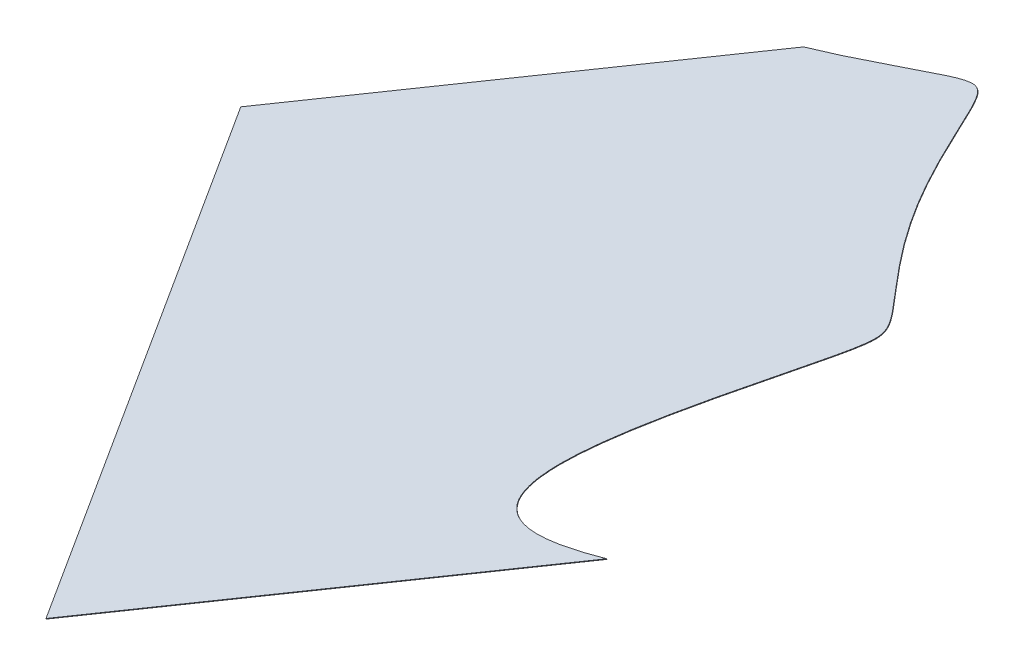
ISO-10303-21;
HEADER;
FILE_DESCRIPTION(('STEP AP214'),'2;1');
FILE_NAME('part.step','',(''),(''),'','','');
FILE_SCHEMA(('AUTOMOTIVE_DESIGN { 1 0 10303 214 1 1 1 1 }'));
ENDSEC;
DATA;
#1=APPLICATION_CONTEXT('core data for automotive mechanical design processes');
#2=APPLICATION_PROTOCOL_DEFINITION('international standard','automotive_design',2000,#1);
#3=PRODUCT_CONTEXT('',#1,'mechanical');
#4=PRODUCT('Part','Part','',(#3));
#5=PRODUCT_RELATED_PRODUCT_CATEGORY('part','',(#4));
#6=PRODUCT_DEFINITION_FORMATION('','',#4);
#7=PRODUCT_DEFINITION_CONTEXT('part definition',#1,'design');
#8=PRODUCT_DEFINITION('design','',#6,#7);
#9=PRODUCT_DEFINITION_SHAPE('','',#8);
#10=(LENGTH_UNIT() NAMED_UNIT(*) SI_UNIT(.MILLI.,.METRE.));
#11=(NAMED_UNIT(*) PLANE_ANGLE_UNIT() SI_UNIT($,.RADIAN.));
#12=(NAMED_UNIT(*) SI_UNIT($,.STERADIAN.) SOLID_ANGLE_UNIT());
#13=UNCERTAINTY_MEASURE_WITH_UNIT(LENGTH_MEASURE(1.E-05),#10,'distance_accuracy_value','');
#14=(GEOMETRIC_REPRESENTATION_CONTEXT(3) GLOBAL_UNCERTAINTY_ASSIGNED_CONTEXT((#13)) GLOBAL_UNIT_ASSIGNED_CONTEXT((#10,
#11,#12)) REPRESENTATION_CONTEXT('',''));
#15=CARTESIAN_POINT('',(0.,0.,0.));
#16=DIRECTION('',(0.,0.,1.));
#17=DIRECTION('',(1.,0.,0.));
#18=AXIS2_PLACEMENT_3D('',#15,#16,#17);
#19=CARTESIAN_POINT('',(1953.44669589325,548.982220738593,241.87330581842));
#20=DIRECTION('',(-0.466019808001318,0.225398203679601,-0.855582367939186));
#21=DIRECTION('',(-0.87818083768511,0.,0.478328774299309));
#22=AXIS2_PLACEMENT_3D('',#19,#20,#21);
#23=PLANE('',#22);
#24=DIRECTION('',(0.856999370345969,0.355384204241095,-0.373167719132479));
#25=VECTOR('',#24,1.);
#26=CARTESIAN_POINT('',(1953.46869080579,548.891507028651,241.837427598694));
#27=LINE('',#26,#25);
#28=CARTESIAN_POINT('',(1953.46869080579,548.891507028651,241.837427598694));
#29=VERTEX_POINT('',#28);
#30=CARTESIAN_POINT('',(2015.71277907775,574.703154673519,214.734158618986));
#31=VERTEX_POINT('',#30);
#32=EDGE_CURVE('E106',#29,#31,#27,.T.);
#33=ORIENTED_EDGE('',*,*,#32,.F.);
#34=DIRECTION('',(0.219949125429105,-0.907137099425403,-0.358782197257666));
#35=VECTOR('',#34,1.);
#36=CARTESIAN_POINT('',(1953.44669589325,548.982220738593,241.87330581842));
#37=LINE('',#36,#35);
#38=CARTESIAN_POINT('',(1953.44669589325,548.982220738593,241.87330581842));
#39=VERTEX_POINT('',#38);
#40=EDGE_CURVE('E13',#39,#29,#37,.T.);
#41=ORIENTED_EDGE('',*,*,#40,.F.);
#42=DIRECTION('',(0.856999370345969,0.355384204241095,-0.373167719132479));
#43=VECTOR('',#42,1.);
#44=CARTESIAN_POINT('',(1953.44669589325,548.982220738593,241.87330581842));
#45=LINE('',#44,#43);
#46=CARTESIAN_POINT('',(2015.69078416521,574.793868383461,214.770036838712));
#47=VERTEX_POINT('',#46);
#48=EDGE_CURVE('E88',#39,#47,#45,.T.);
#49=ORIENTED_EDGE('',*,*,#48,.T.);
#50=DIRECTION('',(0.219949125429105,-0.907137099425403,-0.358782197257666));
#51=VECTOR('',#50,1.);
#52=CARTESIAN_POINT('',(2015.69078416521,574.793868383461,214.770036838712));
#53=LINE('',#52,#51);
#54=EDGE_CURVE('E56',#47,#31,#53,.T.);
#55=ORIENTED_EDGE('',*,*,#54,.T.);
#56=EDGE_LOOP('',(#33,#41,#49,#55));
#57=FACE_BOUND('',#56,.T.);
#58=ADVANCED_FACE('F40',(#57),#23,.T.);
#59=CARTESIAN_POINT('',(1953.44669589325,548.982220738593,241.87330581842));
#60=DIRECTION('',(0.856999370345968,0.355384204241096,-0.373167719132481));
#61=DIRECTION('',(-0.399229280804334,0.,-0.916851122783003));
#62=AXIS2_PLACEMENT_3D('',#59,#60,#61);
#63=PLANE('',#62);
#64=DIRECTION('',(0.46601980800132,-0.225398203679599,0.855582367939185));
#65=VECTOR('',#64,1.);
#66=CARTESIAN_POINT('',(1953.46869080579,548.891507028651,241.837427598694));
#67=LINE('',#66,#65);
#68=CARTESIAN_POINT('',(1990.46222722638,530.998970029593,309.755179045613));
#69=VERTEX_POINT('',#68);
#70=EDGE_CURVE('E94',#29,#69,#67,.T.);
#71=ORIENTED_EDGE('',*,*,#70,.T.);
#72=DIRECTION('',(0.219949125429105,-0.907137099425403,-0.358782197257666));
#73=VECTOR('',#72,1.);
#74=CARTESIAN_POINT('',(1990.44023231384,531.089683739536,309.791057265338));
#75=LINE('',#74,#73);
#76=CARTESIAN_POINT('',(1990.44023231384,531.089683739536,309.791057265338));
#77=VERTEX_POINT('',#76);
#78=EDGE_CURVE('E48',#77,#69,#75,.T.);
#79=ORIENTED_EDGE('',*,*,#78,.F.);
#80=DIRECTION('',(0.46601980800132,-0.225398203679599,0.855582367939185));
#81=VECTOR('',#80,1.);
#82=CARTESIAN_POINT('',(1953.44669589325,548.982220738593,241.87330581842));
#83=LINE('',#82,#81);
#84=EDGE_CURVE('E82',#39,#77,#83,.T.);
#85=ORIENTED_EDGE('',*,*,#84,.F.);
#86=ORIENTED_EDGE('',*,*,#40,.T.);
#87=EDGE_LOOP('',(#71,#79,#85,#86));
#88=FACE_BOUND('',#87,.T.);
#89=ADVANCED_FACE('F92',(#88),#63,.F.);
#90=CARTESIAN_POINT('',(1990.44023231384,531.089683739536,309.791057265338));
#91=DIRECTION('',(-0.466019808001315,0.225398203679601,-0.855582367939187));
#92=DIRECTION('',(-0.878180837685111,0.,0.478328774299307));
#93=AXIS2_PLACEMENT_3D('',#90,#91,#92);
#94=PLANE('',#93);
#95=DIRECTION('',(0.85699937034597,0.355384204241095,-0.373167719132477));
#96=VECTOR('',#95,1.);
#97=CARTESIAN_POINT('',(1990.46222722638,530.998970029593,309.755179045613));
#98=LINE('',#97,#96);
#99=CARTESIAN_POINT('',(2052.48597259183,556.719244925307,282.747855130387));
#100=VERTEX_POINT('',#99);
#101=EDGE_CURVE('E127',#69,#100,#98,.T.);
#102=ORIENTED_EDGE('',*,*,#101,.T.);
#103=DIRECTION('',(0.219949125429105,-0.907137099425403,-0.358782197257666));
#104=VECTOR('',#103,1.);
#105=CARTESIAN_POINT('',(2052.46397767929,556.80995863525,282.783733350113));
#106=LINE('',#105,#104);
#107=CARTESIAN_POINT('',(2052.46397767929,556.80995863525,282.783733350113));
#108=VERTEX_POINT('',#107);
#109=EDGE_CURVE('E70',#108,#100,#106,.T.);
#110=ORIENTED_EDGE('',*,*,#109,.F.);
#111=DIRECTION('',(0.85699937034597,0.355384204241095,-0.373167719132477));
#112=VECTOR('',#111,1.);
#113=CARTESIAN_POINT('',(1990.44023231384,531.089683739536,309.791057265338));
#114=LINE('',#113,#112);
#115=EDGE_CURVE('E87',#77,#108,#114,.T.);
#116=ORIENTED_EDGE('',*,*,#115,.F.);
#117=ORIENTED_EDGE('',*,*,#78,.T.);
#118=EDGE_LOOP('',(#102,#110,#116,#117));
#119=FACE_BOUND('',#118,.T.);
#120=ADVANCED_FACE('F97',(#119),#94,.F.);
#121=CARTESIAN_POINT('',(2015.69078416521,574.793868383461,214.770036838712));
#122=CARTESIAN_POINT('',(2017.5561158413,575.274671333858,214.69791474563));
#123=CARTESIAN_POINT('',(2019.69416695316,575.847452367663,214.560426169518));
#124=CARTESIAN_POINT('',(2021.53957381669,576.341834398673,214.441756245956));
#125=CARTESIAN_POINT('',(2023.68105462988,576.929727516319,214.26816116235));
#126=CARTESIAN_POINT('',(2025.44031449815,577.412690876223,214.125550095261));
#127=CARTESIAN_POINT('',(2027.66178334766,578.031113715501,213.923800480655));
#128=CARTESIAN_POINT('',(2028.49943246852,578.26430237703,213.847726766027));
#129=CARTESIAN_POINT('',(2029.65090272471,578.585836107122,213.740669337398));
#130=CARTESIAN_POINT('',(2030.6447480039,578.863355025246,213.648267020037));
#131=CARTESIAN_POINT('',(2031.63930905602,579.141170934682,213.555552596318));
#132=CARTESIAN_POINT('',(2034.1738062729,579.849145219185,213.319283089905));
#133=CARTESIAN_POINT('',(2035.62079046512,580.244895824693,213.205740252216));
#134=CARTESIAN_POINT('',(2036.77674600766,580.561050008246,213.115034028022));
#135=CARTESIAN_POINT('',(2037.61862253253,580.782529105123,213.071158104742));
#136=CARTESIAN_POINT('',(2038.16734145831,580.926884920416,213.042560621881));
#137=CARTESIAN_POINT('',(2038.62197747392,581.0414935971,213.031498232093));
#138=CARTESIAN_POINT('',(2039.18132027129,581.182497687446,213.017888073994));
#139=CARTESIAN_POINT('',(2039.6290223054,581.286195165266,213.030162489065));
#140=CARTESIAN_POINT('',(2040.20343116855,581.419240686185,213.045910759721));
#141=CARTESIAN_POINT('',(2040.91145787125,581.552440341015,213.143182881302));
#142=CARTESIAN_POINT('',(2041.4095308962,581.625679217081,213.263347775125));
#143=CARTESIAN_POINT('',(2041.88265685357,581.663801098748,213.45700807352));
#144=CARTESIAN_POINT('',(2042.30324627741,581.653936005708,213.739790409436));
#145=CARTESIAN_POINT('',(2042.65579184973,581.595262289171,214.104265559923));
#146=CARTESIAN_POINT('',(2042.94362761912,581.499665028317,214.522427466547));
#147=CARTESIAN_POINT('',(2043.27569538638,581.335300474822,215.141575241982));
#148=CARTESIAN_POINT('',(2043.48514383052,581.17535543995,215.67437781294));
#149=CARTESIAN_POINT('',(2043.64213097823,581.055472406598,216.073727429733));
#150=CARTESIAN_POINT('',(2043.81952455994,580.889328939337,216.602550954379));
#151=CARTESIAN_POINT('',(2043.95419847826,580.763195899328,217.00402396979));
#152=CARTESIAN_POINT('',(2044.11977225121,580.592322372914,217.537560815086));
#153=CARTESIAN_POINT('',(2044.23663092699,580.471723236542,217.91412050877));
#154=CARTESIAN_POINT('',(2044.40706489422,580.28899669804,218.480605762814));
#155=CARTESIAN_POINT('',(2044.54898414278,580.136841505867,218.952314324686));
#156=CARTESIAN_POINT('',(2044.82270480859,579.841420463608,219.867053157739));
#157=CARTESIAN_POINT('',(2045.2899626811,579.350315644315,221.395201337575));
#158=CARTESIAN_POINT('',(2045.56789647397,579.082843585181,222.241857400474));
#159=CARTESIAN_POINT('',(2045.88753759904,578.77523410372,223.215564461048));
#160=CARTESIAN_POINT('',(2046.55160176237,578.210197181406,225.051291795804));
#161=CARTESIAN_POINT('',(2047.67057423651,577.385076245862,227.823488512399));
#162=CARTESIAN_POINT('',(2049.44760771019,576.426926937041,231.335451349033));
#163=CARTESIAN_POINT('',(2051.04144092468,575.800389679922,233.896663746794));
#164=CARTESIAN_POINT('',(2052.17203740678,575.417552928686,235.55772478069));
#165=CARTESIAN_POINT('',(2053.36153125628,575.066153962238,237.175405857126));
#166=CARTESIAN_POINT('',(2054.01255789175,574.895175842118,238.006810919402));
#167=CARTESIAN_POINT('',(2054.5863817734,574.744473362037,238.739622841465));
#168=CARTESIAN_POINT('',(2055.28027398594,574.577325297076,239.58762254279));
#169=CARTESIAN_POINT('',(2055.56957911362,574.507636098379,239.941179849568));
#170=CARTESIAN_POINT('',(2055.92975386732,574.423035897713,240.375883979018));
#171=CARTESIAN_POINT('',(2056.05970574154,574.392511951983,240.532726222317));
#172=CARTESIAN_POINT('',(2056.57769690728,574.271601876211,241.155983789225));
#173=CARTESIAN_POINT('',(2056.98713624293,574.176030089719,241.648629573572));
#174=CARTESIAN_POINT('',(2057.22254394287,574.119867204669,241.934945770822));
#175=CARTESIAN_POINT('',(2057.59318038967,574.03144183811,242.385734840345));
#176=CARTESIAN_POINT('',(2057.86089944492,573.963066940038,242.722735894737));
#177=CARTESIAN_POINT('',(2058.22151523933,573.870966405157,243.176674083165));
#178=CARTESIAN_POINT('',(2058.48178916132,573.793377019387,243.532408656518));
#179=CARTESIAN_POINT('',(2058.82596056558,573.690777236624,244.002811786862));
#180=CARTESIAN_POINT('',(2059.18848222762,573.538885479797,244.609093179564));
#181=CARTESIAN_POINT('',(2059.40584275279,573.413261919271,245.059968532259));
#182=CARTESIAN_POINT('',(2059.55377352892,573.264429862375,245.526960279639));
#183=CARTESIAN_POINT('',(2059.59991396928,573.088342441066,246.000461984614));
#184=CARTESIAN_POINT('',(2059.53119360486,572.888944174193,246.462487644343));
#185=CARTESIAN_POINT('',(2059.3681549014,572.67633742918,246.900088079796));
#186=CARTESIAN_POINT('',(2059.05459237652,572.374148149904,247.471909381786));
#187=CARTESIAN_POINT('',(2058.73149546915,572.129746477429,247.891776764307));
#188=CARTESIAN_POINT('',(2058.48055359521,571.939925367154,248.217878021762));
#189=CARTESIAN_POINT('',(2058.13401286032,571.701653111335,248.607875832474));
#190=CARTESIAN_POINT('',(2057.85475001427,571.509639354814,248.92215893863));
#191=CARTESIAN_POINT('',(2057.50030442041,571.277101559491,249.292811841111));
#192=CARTESIAN_POINT('',(2056.95984005909,570.922524176658,249.85798936814));
#193=CARTESIAN_POINT('',(2056.18445443078,570.43476374814,250.61588703308));
#194=CARTESIAN_POINT('',(2055.6147954892,570.076416779471,251.17269794867));
#195=CARTESIAN_POINT('',(2054.83925761282,569.596454054353,251.91078673533));
#196=CARTESIAN_POINT('',(2054.28437894762,569.253052288469,252.43887147911));
#197=CARTESIAN_POINT('',(2053.48203520935,568.759588047022,253.194664044075));
#198=CARTESIAN_POINT('',(2053.22604554515,568.602147115617,253.43580144651));
#199=CARTESIAN_POINT('',(2052.12043773109,567.922884718318,254.475447928184));
#200=CARTESIAN_POINT('',(2051.29858914855,567.417958078598,255.248264451776));
#201=CARTESIAN_POINT('',(2050.75974804653,567.086156465996,255.756851345722));
#202=CARTESIAN_POINT('',(2050.02552326167,566.634043650707,256.449851752311));
#203=CARTESIAN_POINT('',(2049.40402735175,566.249500407372,257.04111843761));
#204=CARTESIAN_POINT('',(2047.93558836198,565.340921150861,258.43813334982));
#205=CARTESIAN_POINT('',(2046.72944941325,564.582294597931,259.616812467921));
#206=CARTESIAN_POINT('',(2045.30791979076,563.688193533924,261.005978520103));
#207=CARTESIAN_POINT('',(2044.10075437581,562.908399005481,262.237549018274));
#208=CARTESIAN_POINT('',(2042.69534070306,562.00054174033,263.671375729708));
#209=CARTESIAN_POINT('',(2041.51927358197,561.208206444526,264.953718640794));
#210=CARTESIAN_POINT('',(2040.15959687961,560.29217042682,266.436263088613));
#211=CARTESIAN_POINT('',(2039.06905588237,559.50543657709,267.75687466717));
#212=CARTESIAN_POINT('',(2037.7757378265,558.572416089454,269.32304302185));
#213=CARTESIAN_POINT('',(2036.83410140014,557.801916807903,270.693892463888));
#214=CARTESIAN_POINT('',(2035.62504843415,556.812602444556,272.454051201825));
#215=CARTESIAN_POINT('',(2034.97148209541,556.071190788949,273.927955643502));
#216=CARTESIAN_POINT('',(2034.55112313923,555.59433172939,274.875937349242));
#217=CARTESIAN_POINT('',(2034.35623782451,555.21559856133,275.71404485652));
#218=CARTESIAN_POINT('',(2034.11359089145,554.744047168086,276.757551990497));
#219=CARTESIAN_POINT('',(2034.21881543302,554.42109409864,277.638606733391));
#220=CARTESIAN_POINT('',(2034.34245629744,554.041618017514,278.673863037548));
#221=CARTESIAN_POINT('',(2035.5156135139,553.696971431771,280.264456473425));
#222=CARTESIAN_POINT('',(2036.51217964776,553.70591957432,280.85277066268));
#223=CARTESIAN_POINT('',(2037.31956601144,553.713169076414,281.329404212447));
#224=CARTESIAN_POINT('',(2038.41389122379,553.83574657784,281.690350979827));
#225=CARTESIAN_POINT('',(2039.31339193385,553.936501406775,281.987037805544));
#226=CARTESIAN_POINT('',(2040.41154329238,554.115689577615,282.207196982764));
#227=CARTESIAN_POINT('',(2042.15599619246,554.400336426936,282.556927748199));
#228=CARTESIAN_POINT('',(2044.42528093741,554.887088551623,282.717404730933));
#229=CARTESIAN_POINT('',(2046.25198766614,555.278909535466,282.846583929276));
#230=CARTESIAN_POINT('',(2048.44812866024,555.807968267909,282.855253498224));
#231=CARTESIAN_POINT('',(2050.30638720704,556.255629831517,282.86258922969));
#232=CARTESIAN_POINT('',(2052.46397767929,556.809958635251,282.783733350113));
#233=B_SPLINE_CURVE_WITH_KNOTS('',2,(#121,#122,#123,#124,#125,#126,#127,#128,#129,#130,#131,
#132,#133,#134,#135,#136,#137,#138,#139,#140,#141,#142,#143,#144,#145,#146,#147,#148,#149,#150,
#151,#152,#153,#154,#155,#156,#157,#158,#159,#160,#161,#162,#163,#164,#165,#166,#167,#168,#169,
#170,#171,#172,#173,#174,#175,#176,#177,#178,#179,#180,#181,#182,#183,#184,#185,#186,#187,#188,
#189,#190,#191,#192,#193,#194,#195,#196,#197,#198,#199,#200,#201,#202,#203,#204,#205,#206,#207,
#208,#209,#210,#211,#212,#213,#214,#215,#216,#217,#218,#219,#220,#221,#222,#223,#224,#225,#226,
#227,#228,#229,#230,#231,#232),.UNSPECIFIED.,.F.,.F.,(3,2,2,2,2,2,2,2,2,2,1,1,1,1,1,1,1,2,2,2,2,
1,1,2,1,1,1,1,1,1,2,2,2,2,2,2,2,1,1,1,1,1,1,1,2,2,2,2,2,2,2,2,2,2,2,2,2,2,2,2,2,1,2,2,2,2,2,3),
(0.,0.03125,0.0625,0.09375,0.109375,0.125,0.15625,0.171875,0.1796875,0.1875,0.1953125,
0.19921875,0.203125,0.20703125,0.2109375,0.21484375,0.21875,0.2265625,0.234375,0.2421875,0.25,
0.2578125,0.265625,0.28125,0.296875,0.3125,0.34375,0.375,0.390625,0.40625,0.421875,0.4375,
0.4453125,0.453125,0.4609375,0.46875,0.4765625,0.484375,0.48828125,0.4921875,0.49609375,0.5,
0.50390625,0.5078125,0.515625,0.5234375,0.53125,0.546875,0.5625,0.578125,0.59375,0.609375,0.625,
0.656097650527954,0.687195301055908,0.718597650527954,0.75,0.78125,0.8125,0.828125,0.84375,
0.859375,0.875,0.890625,0.90625,0.9375,0.96875,1.),.UNSPECIFIED.);
#234=DIRECTION('',(0.219949125429105,-0.907137099425403,-0.358782197257666));
#235=VECTOR('',#234,1.);
#236=SURFACE_OF_LINEAR_EXTRUSION('',#233,#235);
#237=CARTESIAN_POINT('',(2015.71277907775,574.703154673519,214.734158618986));
#238=CARTESIAN_POINT('',(2017.57811075384,575.183957623915,214.662036525904));
#239=CARTESIAN_POINT('',(2019.7161618657,575.75673865772,214.524547949792));
#240=CARTESIAN_POINT('',(2021.56156872923,576.251120688731,214.40587802623));
#241=CARTESIAN_POINT('',(2023.70304954242,576.839013806376,214.232282942624));
#242=CARTESIAN_POINT('',(2025.4623094107,577.321977166281,214.089671875536));
#243=CARTESIAN_POINT('',(2027.6837782602,577.940400005558,213.887922260929));
#244=CARTESIAN_POINT('',(2028.52142738106,578.173588667088,213.811848546301));
#245=CARTESIAN_POINT('',(2029.67289763725,578.495122397179,213.704791117673));
#246=CARTESIAN_POINT('',(2030.66674291644,578.772641315304,213.612388800311));
#247=CARTESIAN_POINT('',(2031.66130396856,579.050457224739,213.519674376592));
#248=CARTESIAN_POINT('',(2034.19580118545,579.758431509242,213.28340487018));
#249=CARTESIAN_POINT('',(2035.64278537766,580.15418211475,213.16986203249));
#250=CARTESIAN_POINT('',(2036.79874092021,580.470336298303,213.079155808296));
#251=CARTESIAN_POINT('',(2037.64061744507,580.69181539518,213.035279885016));
#252=CARTESIAN_POINT('',(2038.18933637086,580.836171210473,213.006682402155));
#253=CARTESIAN_POINT('',(2038.64397238647,580.950779887158,212.995620012367));
#254=CARTESIAN_POINT('',(2039.20331518383,581.091783977503,212.982009854269));
#255=CARTESIAN_POINT('',(2039.65101721795,581.195481455323,212.994284269339));
#256=CARTESIAN_POINT('',(2040.22542608109,581.328526976243,213.010032539995));
#257=CARTESIAN_POINT('',(2040.93345278379,581.461726631073,213.107304661577));
#258=CARTESIAN_POINT('',(2041.43152580875,581.534965507138,213.227469555399));
#259=CARTESIAN_POINT('',(2041.90465176611,581.573087388805,213.421129853794));
#260=CARTESIAN_POINT('',(2042.32524118995,581.563222295765,213.70391218971));
#261=CARTESIAN_POINT('',(2042.67778676228,581.504548579229,214.068387340198));
#262=CARTESIAN_POINT('',(2042.96562253166,581.408951318375,214.486549246821));
#263=CARTESIAN_POINT('',(2043.29769029892,581.244586764879,215.105697022256));
#264=CARTESIAN_POINT('',(2043.50713874306,581.084641730007,215.638499593214));
#265=CARTESIAN_POINT('',(2043.66412589077,580.964758696656,216.037849210007));
#266=CARTESIAN_POINT('',(2043.84151947249,580.798615229395,216.566672734653));
#267=CARTESIAN_POINT('',(2043.97619339081,580.672482189386,216.968145750064));
#268=CARTESIAN_POINT('',(2044.14176716375,580.501608662971,217.501682595361));
#269=CARTESIAN_POINT('',(2044.25862583954,580.3810095266,217.878242289044));
#270=CARTESIAN_POINT('',(2044.42905980676,580.198282988098,218.444727543088));
#271=CARTESIAN_POINT('',(2044.57097905533,580.046127795925,218.91643610496));
#272=CARTESIAN_POINT('',(2044.84469972113,579.750706753665,219.831174938013));
#273=CARTESIAN_POINT('',(2045.31195759365,579.259601934372,221.35932311785));
#274=CARTESIAN_POINT('',(2045.58989138652,578.992129875239,222.205979180749));
#275=CARTESIAN_POINT('',(2045.90953251158,578.684520393778,223.179686241322));
#276=CARTESIAN_POINT('',(2046.57359667491,578.119483471464,225.015413576078));
#277=CARTESIAN_POINT('',(2047.69256914905,577.29436253592,227.787610292673));
#278=CARTESIAN_POINT('',(2049.46960262273,576.336213227098,231.299573129307));
#279=CARTESIAN_POINT('',(2051.06343583722,575.709675969979,233.860785527068));
#280=CARTESIAN_POINT('',(2052.19403231932,575.326839218744,235.521846560965));
#281=CARTESIAN_POINT('',(2053.38352616882,574.975440252296,237.1395276374));
#282=CARTESIAN_POINT('',(2054.03455280429,574.804462132175,237.970932699676));
#283=CARTESIAN_POINT('',(2054.60837668594,574.653759652094,238.703744621739));
#284=CARTESIAN_POINT('',(2055.30226889849,574.486611587133,239.551744323064));
#285=CARTESIAN_POINT('',(2055.59157402616,574.416922388436,239.905301629842));
#286=CARTESIAN_POINT('',(2055.95174877987,574.332322187771,240.340005759292));
#287=CARTESIAN_POINT('',(2056.08170065408,574.301798242041,240.496848002592));
#288=CARTESIAN_POINT('',(2056.59969181983,574.180888166269,241.120105569499));
#289=CARTESIAN_POINT('',(2057.00913115547,574.085316379777,241.612751353846));
#290=CARTESIAN_POINT('',(2057.24453885541,574.029153494726,241.899067551096));
#291=CARTESIAN_POINT('',(2057.61517530222,573.940728128168,242.349856620619));
#292=CARTESIAN_POINT('',(2057.88289435746,573.872353230095,242.686857675011));
#293=CARTESIAN_POINT('',(2058.24351015187,573.780252695214,243.140795863439));
#294=CARTESIAN_POINT('',(2058.50378407387,573.702663309445,243.496530436793));
#295=CARTESIAN_POINT('',(2058.84795547812,573.600063526681,243.966933567136));
#296=CARTESIAN_POINT('',(2059.21047714017,573.448171769854,244.573214959838));
#297=CARTESIAN_POINT('',(2059.42783766534,573.322548209328,245.024090312533));
#298=CARTESIAN_POINT('',(2059.57576844146,573.173716152433,245.491082059914));
#299=CARTESIAN_POINT('',(2059.62190888182,572.997628731124,245.964583764888));
#300=CARTESIAN_POINT('',(2059.5531885174,572.798230464251,246.426609424618));
#301=CARTESIAN_POINT('',(2059.39014981394,572.585623719238,246.864209860071));
#302=CARTESIAN_POINT('',(2059.07658728907,572.283434439962,247.43603116206));
#303=CARTESIAN_POINT('',(2058.75349038169,572.039032767486,247.855898544581));
#304=CARTESIAN_POINT('',(2058.50254850775,571.849211657211,248.181999802036));
#305=CARTESIAN_POINT('',(2058.15600777286,571.610939401392,248.571997612748));
#306=CARTESIAN_POINT('',(2057.87674492682,571.418925644871,248.886280718905));
#307=CARTESIAN_POINT('',(2057.52229933295,571.186387849549,249.256933621385));
#308=CARTESIAN_POINT('',(2056.98183497163,570.831810466716,249.822111148414));
#309=CARTESIAN_POINT('',(2056.20644934332,570.344050038197,250.580008813354));
#310=CARTESIAN_POINT('',(2055.63679040174,569.985703069529,251.136819728945));
#311=CARTESIAN_POINT('',(2054.86125252536,569.505740344411,251.874908515604));
#312=CARTESIAN_POINT('',(2054.30637386016,569.162338578527,252.402993259384));
#313=CARTESIAN_POINT('',(2053.50403012189,568.66887433708,253.158785824349));
#314=CARTESIAN_POINT('',(2053.24804045769,568.511433405675,253.399923226784));
#315=CARTESIAN_POINT('',(2052.14243264364,567.832171008375,254.439569708458));
#316=CARTESIAN_POINT('',(2051.32058406109,567.327244368655,255.21238623205));
#317=CARTESIAN_POINT('',(2050.78174295907,566.995442756053,255.720973125996));
#318=CARTESIAN_POINT('',(2050.04751817421,566.543329940764,256.413973532585));
#319=CARTESIAN_POINT('',(2049.42602226429,566.15878669743,257.005240217884));
#320=CARTESIAN_POINT('',(2047.95758327453,565.250207440919,258.402255130094));
#321=CARTESIAN_POINT('',(2046.7514443258,564.491580887988,259.580934248195));
#322=CARTESIAN_POINT('',(2045.32991470331,563.597479823982,260.970100300377));
#323=CARTESIAN_POINT('',(2044.12274928835,562.817685295539,262.201670798548));
#324=CARTESIAN_POINT('',(2042.7173356156,561.909828030387,263.635497509982));
#325=CARTESIAN_POINT('',(2041.54126849451,561.117492734583,264.917840421069));
#326=CARTESIAN_POINT('',(2040.18159179215,560.201456716878,266.400384868887));
#327=CARTESIAN_POINT('',(2039.09105079492,559.414722867147,267.720996447444));
#328=CARTESIAN_POINT('',(2037.79773273904,558.481702379511,269.287164802124));
#329=CARTESIAN_POINT('',(2036.85609631268,557.71120309796,270.658014244163));
#330=CARTESIAN_POINT('',(2035.64704334669,556.721888734614,272.4181729821));
#331=CARTESIAN_POINT('',(2034.99347700795,555.980477079007,273.892077423776));
#332=CARTESIAN_POINT('',(2034.57311805177,555.503618019447,274.840059129517));
#333=CARTESIAN_POINT('',(2034.37823273706,555.124884851387,275.678166636794));
#334=CARTESIAN_POINT('',(2034.135585804,554.653333458144,276.721673770771));
#335=CARTESIAN_POINT('',(2034.24081034557,554.330380388698,277.602728513665));
#336=CARTESIAN_POINT('',(2034.36445120998,553.950904307571,278.637984817822));
#337=CARTESIAN_POINT('',(2035.53760842644,553.606257721828,280.2285782537));
#338=CARTESIAN_POINT('',(2036.5341745603,553.615205864378,280.816892442955));
#339=CARTESIAN_POINT('',(2037.34156092398,553.622455366472,281.293525992721));
#340=CARTESIAN_POINT('',(2038.43588613633,553.745032867897,281.654472760101));
#341=CARTESIAN_POINT('',(2039.3353868464,553.845787696833,281.951159585818));
#342=CARTESIAN_POINT('',(2040.43353820492,554.024975867672,282.171318763038));
#343=CARTESIAN_POINT('',(2042.177991105,554.309622716993,282.521049528473));
#344=CARTESIAN_POINT('',(2044.44727584996,554.79637484168,282.681526511207));
#345=CARTESIAN_POINT('',(2046.27398257868,555.188195825523,282.81070570955));
#346=CARTESIAN_POINT('',(2048.47012357278,555.717254557966,282.819375278498));
#347=CARTESIAN_POINT('',(2050.32838211958,556.164916121575,282.826711009964));
#348=CARTESIAN_POINT('',(2052.48597259183,556.719244925309,282.747855130387));
#349=B_SPLINE_CURVE_WITH_KNOTS('',2,(#237,#238,#239,#240,#241,#242,#243,#244,#245,#246,#247,
#248,#249,#250,#251,#252,#253,#254,#255,#256,#257,#258,#259,#260,#261,#262,#263,#264,#265,#266,
#267,#268,#269,#270,#271,#272,#273,#274,#275,#276,#277,#278,#279,#280,#281,#282,#283,#284,#285,
#286,#287,#288,#289,#290,#291,#292,#293,#294,#295,#296,#297,#298,#299,#300,#301,#302,#303,#304,
#305,#306,#307,#308,#309,#310,#311,#312,#313,#314,#315,#316,#317,#318,#319,#320,#321,#322,#323,
#324,#325,#326,#327,#328,#329,#330,#331,#332,#333,#334,#335,#336,#337,#338,#339,#340,#341,#342,
#343,#344,#345,#346,#347,#348),.UNSPECIFIED.,.F.,.F.,(3,2,2,2,2,2,2,2,2,2,1,1,1,1,1,1,1,2,2,2,2,
1,1,2,1,1,1,1,1,1,2,2,2,2,2,2,2,1,1,1,1,1,1,1,2,2,2,2,2,2,2,2,2,2,2,2,2,2,2,2,2,1,2,2,2,2,2,3),
(0.,0.03125,0.0625,0.09375,0.109375,0.125,0.15625,0.171875,0.1796875,0.1875,0.1953125,
0.19921875,0.203125,0.20703125,0.2109375,0.21484375,0.21875,0.2265625,0.234375,0.2421875,0.25,
0.2578125,0.265625,0.28125,0.296875,0.3125,0.34375,0.375,0.390625,0.40625,0.421875,0.4375,
0.4453125,0.453125,0.4609375,0.46875,0.4765625,0.484375,0.48828125,0.4921875,0.49609375,0.5,
0.50390625,0.5078125,0.515625,0.5234375,0.53125,0.546875,0.5625,0.578125,0.59375,0.609375,0.625,
0.656097650527954,0.687195301055908,0.718597650527954,0.75,0.78125,0.8125,0.828125,0.84375,
0.859375,0.875,0.890625,0.90625,0.9375,0.96875,1.),.UNSPECIFIED.);
#350=EDGE_CURVE('E128',#31,#100,#349,.T.);
#351=ORIENTED_EDGE('',*,*,#350,.F.);
#352=ORIENTED_EDGE('',*,*,#54,.F.);
#353=EDGE_CURVE('E98',#47,#108,#233,.T.);
#354=ORIENTED_EDGE('',*,*,#353,.T.);
#355=ORIENTED_EDGE('',*,*,#109,.T.);
#356=EDGE_LOOP('',(#351,#352,#354,#355));
#357=FACE_BOUND('',#356,.T.);
#358=ADVANCED_FACE('F112',(#357),#236,.T.);
#359=CARTESIAN_POINT('',(2299.66026224415,996.617649313699,-677.674363126148));
#360=DIRECTION('',(-0.219949125429106,0.907137099425403,0.358782197257664));
#361=DIRECTION('',(0.,-0.367788851942901,0.929909329121137));
#362=AXIS2_PLACEMENT_3D('',#359,#360,#361);
#363=PLANE('',#362);
#364=ORIENTED_EDGE('',*,*,#48,.F.);
#365=ORIENTED_EDGE('',*,*,#84,.T.);
#366=ORIENTED_EDGE('',*,*,#115,.T.);
#367=ORIENTED_EDGE('',*,*,#353,.F.);
#368=EDGE_LOOP('',(#364,#365,#366,#367));
#369=FACE_BOUND('',#368,.T.);
#370=ADVANCED_FACE('F84',(#369),#363,.T.);
#371=CARTESIAN_POINT('',(2299.68225715669,996.526935603757,-677.710241345874));
#372=DIRECTION('',(-0.219949125429106,0.907137099425403,0.358782197257664));
#373=DIRECTION('',(0.,-0.367788851942901,0.929909329121137));
#374=AXIS2_PLACEMENT_3D('',#371,#372,#373);
#375=PLANE('',#374);
#376=ORIENTED_EDGE('',*,*,#32,.T.);
#377=ORIENTED_EDGE('',*,*,#350,.T.);
#378=ORIENTED_EDGE('',*,*,#101,.F.);
#379=ORIENTED_EDGE('',*,*,#70,.F.);
#380=EDGE_LOOP('',(#376,#377,#378,#379));
#381=FACE_BOUND('',#380,.T.);
#382=ADVANCED_FACE('F116',(#381),#375,.F.);
#383=CLOSED_SHELL('',(#58,#89,#120,#358,#370,#382));
#384=MANIFOLD_SOLID_BREP('B2',#383);
#385=ADVANCED_BREP_SHAPE_REPRESENTATION('',(#18,#384),#14);
#386=SHAPE_DEFINITION_REPRESENTATION(#9,#385);
ENDSEC;
END-ISO-10303-21;
